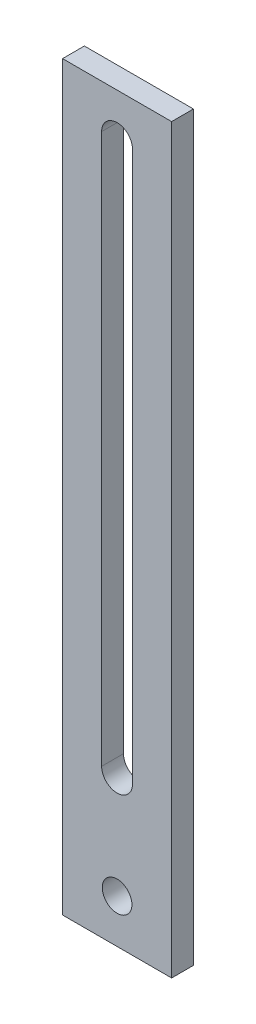
ISO-10303-21;
HEADER;
FILE_DESCRIPTION(('STEP AP214'),'2;1');
FILE_NAME('part.step','',(''),(''),'','','');
FILE_SCHEMA(('AUTOMOTIVE_DESIGN { 1 0 10303 214 1 1 1 1 }'));
ENDSEC;
DATA;
#1=APPLICATION_CONTEXT('core data for automotive mechanical design processes');
#2=APPLICATION_PROTOCOL_DEFINITION('international standard','automotive_design',2000,#1);
#3=PRODUCT_CONTEXT('',#1,'mechanical');
#4=PRODUCT('Part','Part','',(#3));
#5=PRODUCT_RELATED_PRODUCT_CATEGORY('part','',(#4));
#6=PRODUCT_DEFINITION_FORMATION('','',#4);
#7=PRODUCT_DEFINITION_CONTEXT('part definition',#1,'design');
#8=PRODUCT_DEFINITION('design','',#6,#7);
#9=PRODUCT_DEFINITION_SHAPE('','',#8);
#10=(LENGTH_UNIT() NAMED_UNIT(*) SI_UNIT(.MILLI.,.METRE.));
#11=(NAMED_UNIT(*) PLANE_ANGLE_UNIT() SI_UNIT($,.RADIAN.));
#12=(NAMED_UNIT(*) SI_UNIT($,.STERADIAN.) SOLID_ANGLE_UNIT());
#13=UNCERTAINTY_MEASURE_WITH_UNIT(LENGTH_MEASURE(1.E-05),#10,'distance_accuracy_value','');
#14=(GEOMETRIC_REPRESENTATION_CONTEXT(3) GLOBAL_UNCERTAINTY_ASSIGNED_CONTEXT((#13)) GLOBAL_UNIT_ASSIGNED_CONTEXT((#10,
#11,#12)) REPRESENTATION_CONTEXT('',''));
#15=CARTESIAN_POINT('',(0.,0.,0.));
#16=DIRECTION('',(0.,0.,1.));
#17=DIRECTION('',(1.,0.,0.));
#18=AXIS2_PLACEMENT_3D('',#15,#16,#17);
#19=CARTESIAN_POINT('',(0.,0.,3.175));
#20=DIRECTION('',(0.,0.,-1.));
#21=DIRECTION('',(-1.,0.,0.));
#22=AXIS2_PLACEMENT_3D('',#19,#20,#21);
#23=PLANE('',#22);
#24=DIRECTION('',(0.,-1.,0.));
#25=VECTOR('',#24,1.);
#26=CARTESIAN_POINT('',(0.,0.,3.175));
#27=LINE('',#26,#25);
#28=CARTESIAN_POINT('',(0.,107.95,3.175));
#29=VERTEX_POINT('',#28);
#30=CARTESIAN_POINT('',(0.,0.,3.175));
#31=VERTEX_POINT('',#30);
#32=EDGE_CURVE('E137',#29,#31,#27,.T.);
#33=ORIENTED_EDGE('',*,*,#32,.T.);
#34=DIRECTION('',(1.,0.,0.));
#35=VECTOR('',#34,1.);
#36=CARTESIAN_POINT('',(0.,0.,3.175));
#37=LINE('',#36,#35);
#38=CARTESIAN_POINT('',(15.875,0.,3.175));
#39=VERTEX_POINT('',#38);
#40=EDGE_CURVE('E140',#31,#39,#37,.T.);
#41=ORIENTED_EDGE('',*,*,#40,.T.);
#42=DIRECTION('',(0.,1.,0.));
#43=VECTOR('',#42,1.);
#44=CARTESIAN_POINT('',(15.875,0.,3.175));
#45=LINE('',#44,#43);
#46=CARTESIAN_POINT('',(15.875,107.95,3.175));
#47=VERTEX_POINT('',#46);
#48=EDGE_CURVE('E143',#39,#47,#45,.T.);
#49=ORIENTED_EDGE('',*,*,#48,.T.);
#50=DIRECTION('',(-1.,0.,0.));
#51=VECTOR('',#50,1.);
#52=CARTESIAN_POINT('',(0.,107.95,3.175));
#53=LINE('',#52,#51);
#54=EDGE_CURVE('E145',#47,#29,#53,.T.);
#55=ORIENTED_EDGE('',*,*,#54,.T.);
#56=EDGE_LOOP('',(#33,#41,#49,#55));
#57=FACE_BOUND('',#56,.T.);
#58=CARTESIAN_POINT('',(7.9375,101.6,3.175));
#59=DIRECTION('',(0.,0.,1.));
#60=DIRECTION('',(1.,0.,0.));
#61=AXIS2_PLACEMENT_3D('',#58,#59,#60);
#62=CIRCLE('',#61,2.2479);
#63=CARTESIAN_POINT('',(10.1854,101.6,3.175));
#64=VERTEX_POINT('',#63);
#65=CARTESIAN_POINT('',(5.6896,101.6,3.175));
#66=VERTEX_POINT('',#65);
#67=EDGE_CURVE('E98',#64,#66,#62,.T.);
#68=ORIENTED_EDGE('',*,*,#67,.F.);
#69=DIRECTION('',(0.,1.,0.));
#70=VECTOR('',#69,1.);
#71=CARTESIAN_POINT('',(10.1854,101.6,3.175));
#72=LINE('',#71,#70);
#73=CARTESIAN_POINT('',(10.1854,21.59,3.175));
#74=VERTEX_POINT('',#73);
#75=EDGE_CURVE('E121',#74,#64,#72,.T.);
#76=ORIENTED_EDGE('',*,*,#75,.F.);
#77=CARTESIAN_POINT('',(7.93750000000001,21.59,3.175));
#78=DIRECTION('',(0.,0.,1.));
#79=DIRECTION('',(1.,0.,0.));
#80=AXIS2_PLACEMENT_3D('',#77,#78,#79);
#81=CIRCLE('',#80,2.2479);
#82=CARTESIAN_POINT('',(5.68960000000001,21.59,3.175));
#83=VERTEX_POINT('',#82);
#84=EDGE_CURVE('E119',#83,#74,#81,.T.);
#85=ORIENTED_EDGE('',*,*,#84,.F.);
#86=DIRECTION('',(0.,-1.,0.));
#87=VECTOR('',#86,1.);
#88=CARTESIAN_POINT('',(5.6896,101.6,3.175));
#89=LINE('',#88,#87);
#90=EDGE_CURVE('E106',#66,#83,#89,.T.);
#91=ORIENTED_EDGE('',*,*,#90,.F.);
#92=EDGE_LOOP('',(#68,#76,#85,#91));
#93=FACE_BOUND('',#92,.T.);
#94=CARTESIAN_POINT('',(7.9375,6.35,3.175));
#95=DIRECTION('',(0.,0.,1.));
#96=DIRECTION('',(1.,0.,0.));
#97=AXIS2_PLACEMENT_3D('',#94,#95,#96);
#98=CIRCLE('',#97,2.159);
#99=CARTESIAN_POINT('',(10.0965,6.35,3.175));
#100=VERTEX_POINT('',#99);
#101=EDGE_CURVE('E127',#100,#100,#98,.T.);
#102=ORIENTED_EDGE('',*,*,#101,.F.);
#103=EDGE_LOOP('',(#102));
#104=FACE_BOUND('',#103,.T.);
#105=ADVANCED_FACE('F33',(#57,#93,#104),#23,.F.);
#106=CARTESIAN_POINT('',(0.,0.,0.));
#107=DIRECTION('',(0.,0.,-1.));
#108=DIRECTION('',(-1.,0.,0.));
#109=AXIS2_PLACEMENT_3D('',#106,#107,#108);
#110=PLANE('',#109);
#111=DIRECTION('',(0.,1.,0.));
#112=VECTOR('',#111,1.);
#113=CARTESIAN_POINT('',(10.1854,101.6,0.));
#114=LINE('',#113,#112);
#115=CARTESIAN_POINT('',(10.1854,21.59,0.));
#116=VERTEX_POINT('',#115);
#117=CARTESIAN_POINT('',(10.1854,101.6,0.));
#118=VERTEX_POINT('',#117);
#119=EDGE_CURVE('E107',#116,#118,#114,.T.);
#120=ORIENTED_EDGE('',*,*,#119,.T.);
#121=CARTESIAN_POINT('',(7.9375,101.6,0.));
#122=DIRECTION('',(0.,0.,1.));
#123=DIRECTION('',(1.,0.,0.));
#124=AXIS2_PLACEMENT_3D('',#121,#122,#123);
#125=CIRCLE('',#124,2.2479);
#126=CARTESIAN_POINT('',(5.6896,101.6,0.));
#127=VERTEX_POINT('',#126);
#128=EDGE_CURVE('E56',#118,#127,#125,.T.);
#129=ORIENTED_EDGE('',*,*,#128,.T.);
#130=DIRECTION('',(0.,-1.,0.));
#131=VECTOR('',#130,1.);
#132=CARTESIAN_POINT('',(5.6896,101.6,0.));
#133=LINE('',#132,#131);
#134=CARTESIAN_POINT('',(5.68960000000001,21.59,0.));
#135=VERTEX_POINT('',#134);
#136=EDGE_CURVE('E113',#127,#135,#133,.T.);
#137=ORIENTED_EDGE('',*,*,#136,.T.);
#138=CARTESIAN_POINT('',(7.93750000000001,21.59,0.));
#139=DIRECTION('',(0.,0.,1.));
#140=DIRECTION('',(1.,0.,0.));
#141=AXIS2_PLACEMENT_3D('',#138,#139,#140);
#142=CIRCLE('',#141,2.2479);
#143=EDGE_CURVE('E129',#135,#116,#142,.T.);
#144=ORIENTED_EDGE('',*,*,#143,.T.);
#145=EDGE_LOOP('',(#120,#129,#137,#144));
#146=FACE_BOUND('',#145,.T.);
#147=DIRECTION('',(0.,-1.,0.));
#148=VECTOR('',#147,1.);
#149=CARTESIAN_POINT('',(0.,0.,0.));
#150=LINE('',#149,#148);
#151=CARTESIAN_POINT('',(0.,107.95,0.));
#152=VERTEX_POINT('',#151);
#153=CARTESIAN_POINT('',(0.,0.,0.));
#154=VERTEX_POINT('',#153);
#155=EDGE_CURVE('E114',#152,#154,#150,.T.);
#156=ORIENTED_EDGE('',*,*,#155,.F.);
#157=DIRECTION('',(-1.,0.,0.));
#158=VECTOR('',#157,1.);
#159=CARTESIAN_POINT('',(0.,107.95,0.));
#160=LINE('',#159,#158);
#161=CARTESIAN_POINT('',(15.875,107.95,0.));
#162=VERTEX_POINT('',#161);
#163=EDGE_CURVE('E141',#162,#152,#160,.T.);
#164=ORIENTED_EDGE('',*,*,#163,.F.);
#165=DIRECTION('',(0.,1.,0.));
#166=VECTOR('',#165,1.);
#167=CARTESIAN_POINT('',(15.875,0.,0.));
#168=LINE('',#167,#166);
#169=CARTESIAN_POINT('',(15.875,0.,0.));
#170=VERTEX_POINT('',#169);
#171=EDGE_CURVE('E152',#170,#162,#168,.T.);
#172=ORIENTED_EDGE('',*,*,#171,.F.);
#173=DIRECTION('',(1.,0.,0.));
#174=VECTOR('',#173,1.);
#175=CARTESIAN_POINT('',(0.,0.,0.));
#176=LINE('',#175,#174);
#177=EDGE_CURVE('E150',#154,#170,#176,.T.);
#178=ORIENTED_EDGE('',*,*,#177,.F.);
#179=EDGE_LOOP('',(#156,#164,#172,#178));
#180=FACE_BOUND('',#179,.T.);
#181=CARTESIAN_POINT('',(7.9375,6.35,0.));
#182=DIRECTION('',(0.,0.,1.));
#183=DIRECTION('',(1.,0.,0.));
#184=AXIS2_PLACEMENT_3D('',#181,#182,#183);
#185=CIRCLE('',#184,2.159);
#186=CARTESIAN_POINT('',(10.0965,6.35,0.));
#187=VERTEX_POINT('',#186);
#188=EDGE_CURVE('E224',#187,#187,#185,.T.);
#189=ORIENTED_EDGE('',*,*,#188,.T.);
#190=EDGE_LOOP('',(#189));
#191=FACE_BOUND('',#190,.T.);
#192=ADVANCED_FACE('F170',(#146,#180,#191),#110,.T.);
#193=CARTESIAN_POINT('',(0.,0.,3.175));
#194=DIRECTION('',(1.,0.,0.));
#195=DIRECTION('',(0.,0.,-1.));
#196=AXIS2_PLACEMENT_3D('',#193,#194,#195);
#197=PLANE('',#196);
#198=ORIENTED_EDGE('',*,*,#155,.T.);
#199=DIRECTION('',(0.,0.,-1.));
#200=VECTOR('',#199,1.);
#201=CARTESIAN_POINT('',(0.,0.,3.175));
#202=LINE('',#201,#200);
#203=EDGE_CURVE('E11',#31,#154,#202,.T.);
#204=ORIENTED_EDGE('',*,*,#203,.F.);
#205=ORIENTED_EDGE('',*,*,#32,.F.);
#206=DIRECTION('',(0.,0.,-1.));
#207=VECTOR('',#206,1.);
#208=CARTESIAN_POINT('',(0.,107.95,3.175));
#209=LINE('',#208,#207);
#210=EDGE_CURVE('E147',#29,#152,#209,.T.);
#211=ORIENTED_EDGE('',*,*,#210,.T.);
#212=EDGE_LOOP('',(#198,#204,#205,#211));
#213=FACE_BOUND('',#212,.T.);
#214=ADVANCED_FACE('F35',(#213),#197,.F.);
#215=CARTESIAN_POINT('',(0.,0.,3.175));
#216=DIRECTION('',(0.,1.,0.));
#217=DIRECTION('',(0.,0.,1.));
#218=AXIS2_PLACEMENT_3D('',#215,#216,#217);
#219=PLANE('',#218);
#220=ORIENTED_EDGE('',*,*,#177,.T.);
#221=DIRECTION('',(0.,0.,-1.));
#222=VECTOR('',#221,1.);
#223=CARTESIAN_POINT('',(15.875,0.,3.175));
#224=LINE('',#223,#222);
#225=EDGE_CURVE('E41',#39,#170,#224,.T.);
#226=ORIENTED_EDGE('',*,*,#225,.F.);
#227=ORIENTED_EDGE('',*,*,#40,.F.);
#228=ORIENTED_EDGE('',*,*,#203,.T.);
#229=EDGE_LOOP('',(#220,#226,#227,#228));
#230=FACE_BOUND('',#229,.T.);
#231=ADVANCED_FACE('F180',(#230),#219,.F.);
#232=CARTESIAN_POINT('',(15.875,0.,3.175));
#233=DIRECTION('',(-1.,0.,0.));
#234=DIRECTION('',(0.,0.,1.));
#235=AXIS2_PLACEMENT_3D('',#232,#233,#234);
#236=PLANE('',#235);
#237=ORIENTED_EDGE('',*,*,#171,.T.);
#238=DIRECTION('',(0.,0.,-1.));
#239=VECTOR('',#238,1.);
#240=CARTESIAN_POINT('',(15.875,107.95,3.175));
#241=LINE('',#240,#239);
#242=EDGE_CURVE('E157',#47,#162,#241,.T.);
#243=ORIENTED_EDGE('',*,*,#242,.F.);
#244=ORIENTED_EDGE('',*,*,#48,.F.);
#245=ORIENTED_EDGE('',*,*,#225,.T.);
#246=EDGE_LOOP('',(#237,#243,#244,#245));
#247=FACE_BOUND('',#246,.T.);
#248=ADVANCED_FACE('F164',(#247),#236,.F.);
#249=CARTESIAN_POINT('',(0.,107.95,3.175));
#250=DIRECTION('',(0.,-1.,0.));
#251=DIRECTION('',(0.,0.,-1.));
#252=AXIS2_PLACEMENT_3D('',#249,#250,#251);
#253=PLANE('',#252);
#254=ORIENTED_EDGE('',*,*,#163,.T.);
#255=ORIENTED_EDGE('',*,*,#210,.F.);
#256=ORIENTED_EDGE('',*,*,#54,.F.);
#257=ORIENTED_EDGE('',*,*,#242,.T.);
#258=EDGE_LOOP('',(#254,#255,#256,#257));
#259=FACE_BOUND('',#258,.T.);
#260=ADVANCED_FACE('F174',(#259),#253,.F.);
#261=CARTESIAN_POINT('',(7.9375,101.6,3.175));
#262=DIRECTION('',(0.,0.,-1.));
#263=DIRECTION('',(-1.,0.,0.));
#264=AXIS2_PLACEMENT_3D('',#261,#262,#263);
#265=CYLINDRICAL_SURFACE('',#264,2.2479);
#266=ORIENTED_EDGE('',*,*,#128,.F.);
#267=DIRECTION('',(0.,0.,-1.));
#268=VECTOR('',#267,1.);
#269=CARTESIAN_POINT('',(10.1854,101.6,3.175));
#270=LINE('',#269,#268);
#271=EDGE_CURVE('E102',#64,#118,#270,.T.);
#272=ORIENTED_EDGE('',*,*,#271,.F.);
#273=ORIENTED_EDGE('',*,*,#67,.T.);
#274=DIRECTION('',(0.,0.,-1.));
#275=VECTOR('',#274,1.);
#276=CARTESIAN_POINT('',(5.6896,101.6,3.175));
#277=LINE('',#276,#275);
#278=EDGE_CURVE('E101',#66,#127,#277,.T.);
#279=ORIENTED_EDGE('',*,*,#278,.T.);
#280=EDGE_LOOP('',(#266,#272,#273,#279));
#281=FACE_BOUND('',#280,.T.);
#282=ADVANCED_FACE('F100',(#281),#265,.F.);
#283=CARTESIAN_POINT('',(5.6896,101.6,3.175));
#284=DIRECTION('',(1.,0.,0.));
#285=DIRECTION('',(0.,1.,0.));
#286=AXIS2_PLACEMENT_3D('',#283,#284,#285);
#287=PLANE('',#286);
#288=ORIENTED_EDGE('',*,*,#136,.F.);
#289=ORIENTED_EDGE('',*,*,#278,.F.);
#290=ORIENTED_EDGE('',*,*,#90,.T.);
#291=DIRECTION('',(0.,0.,-1.));
#292=VECTOR('',#291,1.);
#293=CARTESIAN_POINT('',(5.68960000000001,21.59,3.175));
#294=LINE('',#293,#292);
#295=EDGE_CURVE('E115',#83,#135,#294,.T.);
#296=ORIENTED_EDGE('',*,*,#295,.T.);
#297=EDGE_LOOP('',(#288,#289,#290,#296));
#298=FACE_BOUND('',#297,.T.);
#299=ADVANCED_FACE('F110',(#298),#287,.T.);
#300=CARTESIAN_POINT('',(7.93750000000001,21.59,3.175));
#301=DIRECTION('',(0.,0.,-1.));
#302=DIRECTION('',(-1.,0.,0.));
#303=AXIS2_PLACEMENT_3D('',#300,#301,#302);
#304=CYLINDRICAL_SURFACE('',#303,2.2479);
#305=ORIENTED_EDGE('',*,*,#143,.F.);
#306=ORIENTED_EDGE('',*,*,#295,.F.);
#307=ORIENTED_EDGE('',*,*,#84,.T.);
#308=DIRECTION('',(0.,0.,-1.));
#309=VECTOR('',#308,1.);
#310=CARTESIAN_POINT('',(10.1854,21.59,3.175));
#311=LINE('',#310,#309);
#312=EDGE_CURVE('E48',#74,#116,#311,.T.);
#313=ORIENTED_EDGE('',*,*,#312,.T.);
#314=EDGE_LOOP('',(#305,#306,#307,#313));
#315=FACE_BOUND('',#314,.T.);
#316=ADVANCED_FACE('F204',(#315),#304,.F.);
#317=CARTESIAN_POINT('',(10.1854,101.6,3.175));
#318=DIRECTION('',(-1.,0.,0.));
#319=DIRECTION('',(0.,-1.,0.));
#320=AXIS2_PLACEMENT_3D('',#317,#318,#319);
#321=PLANE('',#320);
#322=ORIENTED_EDGE('',*,*,#119,.F.);
#323=ORIENTED_EDGE('',*,*,#312,.F.);
#324=ORIENTED_EDGE('',*,*,#75,.T.);
#325=ORIENTED_EDGE('',*,*,#271,.T.);
#326=EDGE_LOOP('',(#322,#323,#324,#325));
#327=FACE_BOUND('',#326,.T.);
#328=ADVANCED_FACE('F208',(#327),#321,.T.);
#329=CARTESIAN_POINT('',(7.9375,6.35,3.175));
#330=DIRECTION('',(0.,0.,-1.));
#331=DIRECTION('',(-1.,0.,0.));
#332=AXIS2_PLACEMENT_3D('',#329,#330,#331);
#333=CYLINDRICAL_SURFACE('',#332,2.159);
#334=ORIENTED_EDGE('',*,*,#101,.T.);
#335=EDGE_LOOP('',(#334));
#336=FACE_BOUND('',#335,.T.);
#337=ORIENTED_EDGE('',*,*,#188,.F.);
#338=EDGE_LOOP('',(#337));
#339=FACE_BOUND('',#338,.T.);
#340=ADVANCED_FACE('F214',(#336,#339),#333,.F.);
#341=CLOSED_SHELL('',(#105,#192,#214,#231,#248,#260,#282,#299,#316,#328,#340));
#342=MANIFOLD_SOLID_BREP('B2',#341);
#343=ADVANCED_BREP_SHAPE_REPRESENTATION('',(#18,#342),#14);
#344=SHAPE_DEFINITION_REPRESENTATION(#9,#343);
ENDSEC;
END-ISO-10303-21;
